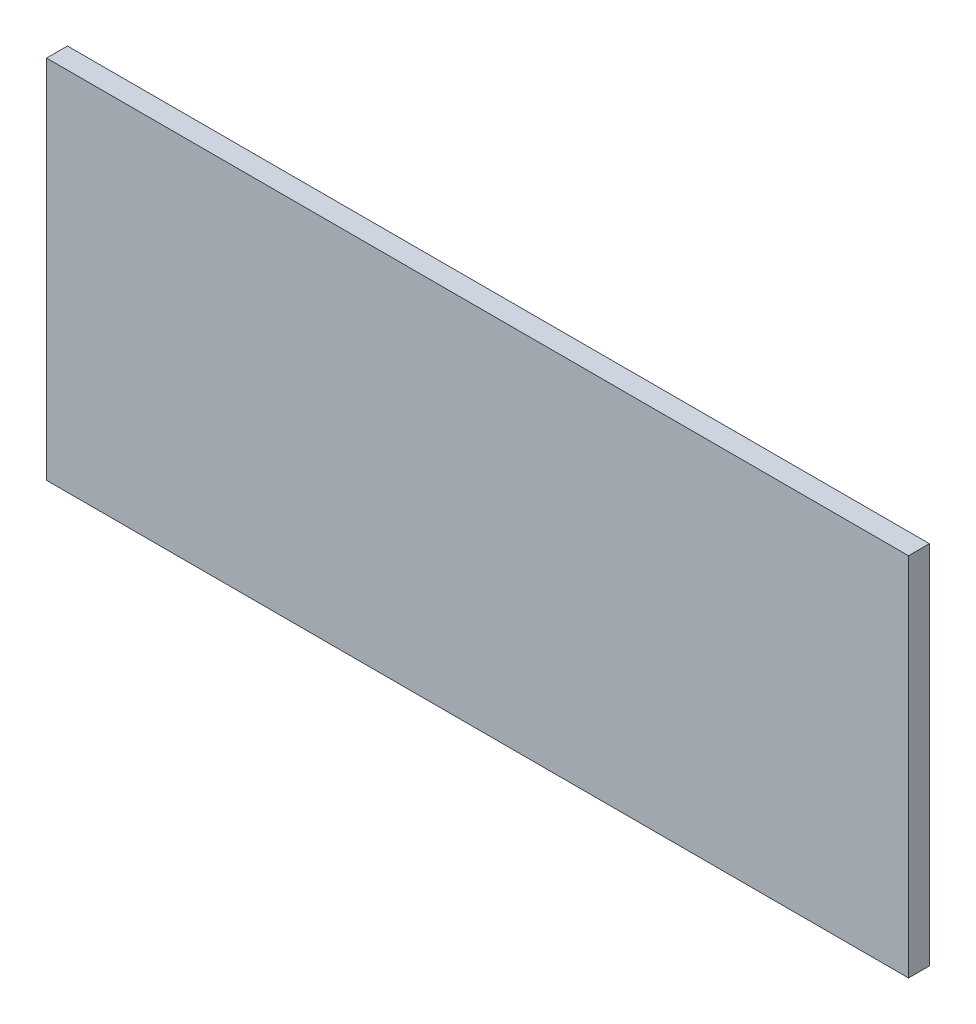
ISO-10303-21;
HEADER;
FILE_DESCRIPTION(('STEP AP214'),'2;1');
FILE_NAME('part.step','',(''),(''),'','','');
FILE_SCHEMA(('AUTOMOTIVE_DESIGN { 1 0 10303 214 1 1 1 1 }'));
ENDSEC;
DATA;
#1=APPLICATION_CONTEXT('core data for automotive mechanical design processes');
#2=APPLICATION_PROTOCOL_DEFINITION('international standard','automotive_design',2000,#1);
#3=PRODUCT_CONTEXT('',#1,'mechanical');
#4=PRODUCT('Part','Part','',(#3));
#5=PRODUCT_RELATED_PRODUCT_CATEGORY('part','',(#4));
#6=PRODUCT_DEFINITION_FORMATION('','',#4);
#7=PRODUCT_DEFINITION_CONTEXT('part definition',#1,'design');
#8=PRODUCT_DEFINITION('design','',#6,#7);
#9=PRODUCT_DEFINITION_SHAPE('','',#8);
#10=(LENGTH_UNIT() NAMED_UNIT(*) SI_UNIT(.MILLI.,.METRE.));
#11=(NAMED_UNIT(*) PLANE_ANGLE_UNIT() SI_UNIT($,.RADIAN.));
#12=(NAMED_UNIT(*) SI_UNIT($,.STERADIAN.) SOLID_ANGLE_UNIT());
#13=UNCERTAINTY_MEASURE_WITH_UNIT(LENGTH_MEASURE(1.E-05),#10,'distance_accuracy_value','');
#14=(GEOMETRIC_REPRESENTATION_CONTEXT(3) GLOBAL_UNCERTAINTY_ASSIGNED_CONTEXT((#13)) GLOBAL_UNIT_ASSIGNED_CONTEXT((#10,
#11,#12)) REPRESENTATION_CONTEXT('',''));
#15=CARTESIAN_POINT('',(0.,0.,0.));
#16=DIRECTION('',(0.,0.,1.));
#17=DIRECTION('',(1.,0.,0.));
#18=AXIS2_PLACEMENT_3D('',#15,#16,#17);
#19=CARTESIAN_POINT('',(-82.5,-35.,4.));
#20=DIRECTION('',(1.,0.,0.));
#21=DIRECTION('',(0.,0.,-1.));
#22=AXIS2_PLACEMENT_3D('',#19,#20,#21);
#23=PLANE('',#22);
#24=DIRECTION('',(0.,-1.,0.));
#25=VECTOR('',#24,1.);
#26=CARTESIAN_POINT('',(-82.5,-35.,0.));
#27=LINE('',#26,#25);
#28=CARTESIAN_POINT('',(-82.5,35.,0.));
#29=VERTEX_POINT('',#28);
#30=CARTESIAN_POINT('',(-82.5,-35.,0.));
#31=VERTEX_POINT('',#30);
#32=EDGE_CURVE('E97',#29,#31,#27,.T.);
#33=ORIENTED_EDGE('',*,*,#32,.T.);
#34=DIRECTION('',(0.,0.,-1.));
#35=VECTOR('',#34,1.);
#36=CARTESIAN_POINT('',(-82.5,-35.,4.));
#37=LINE('',#36,#35);
#38=CARTESIAN_POINT('',(-82.5,-35.,4.));
#39=VERTEX_POINT('',#38);
#40=EDGE_CURVE('E11',#39,#31,#37,.T.);
#41=ORIENTED_EDGE('',*,*,#40,.F.);
#42=DIRECTION('',(0.,-1.,0.));
#43=VECTOR('',#42,1.);
#44=CARTESIAN_POINT('',(-82.5,-35.,4.));
#45=LINE('',#44,#43);
#46=CARTESIAN_POINT('',(-82.5,35.,4.));
#47=VERTEX_POINT('',#46);
#48=EDGE_CURVE('E85',#47,#39,#45,.T.);
#49=ORIENTED_EDGE('',*,*,#48,.F.);
#50=DIRECTION('',(0.,0.,-1.));
#51=VECTOR('',#50,1.);
#52=CARTESIAN_POINT('',(-82.5,35.,4.));
#53=LINE('',#52,#51);
#54=EDGE_CURVE('E93',#47,#29,#53,.T.);
#55=ORIENTED_EDGE('',*,*,#54,.T.);
#56=EDGE_LOOP('',(#33,#41,#49,#55));
#57=FACE_BOUND('',#56,.T.);
#58=ADVANCED_FACE('F34',(#57),#23,.F.);
#59=CARTESIAN_POINT('',(82.5,-35.,4.));
#60=DIRECTION('',(0.,1.,0.));
#61=DIRECTION('',(-1.,0.,0.));
#62=AXIS2_PLACEMENT_3D('',#59,#60,#61);
#63=PLANE('',#62);
#64=DIRECTION('',(1.,0.,0.));
#65=VECTOR('',#64,1.);
#66=CARTESIAN_POINT('',(82.5,-35.,0.));
#67=LINE('',#66,#65);
#68=CARTESIAN_POINT('',(82.5,-35.,0.));
#69=VERTEX_POINT('',#68);
#70=EDGE_CURVE('E89',#31,#69,#67,.T.);
#71=ORIENTED_EDGE('',*,*,#70,.T.);
#72=DIRECTION('',(0.,0.,-1.));
#73=VECTOR('',#72,1.);
#74=CARTESIAN_POINT('',(82.5,-35.,4.));
#75=LINE('',#74,#73);
#76=CARTESIAN_POINT('',(82.5,-35.,4.));
#77=VERTEX_POINT('',#76);
#78=EDGE_CURVE('E42',#77,#69,#75,.T.);
#79=ORIENTED_EDGE('',*,*,#78,.F.);
#80=DIRECTION('',(1.,0.,0.));
#81=VECTOR('',#80,1.);
#82=CARTESIAN_POINT('',(82.5,-35.,4.));
#83=LINE('',#82,#81);
#84=EDGE_CURVE('E80',#39,#77,#83,.T.);
#85=ORIENTED_EDGE('',*,*,#84,.F.);
#86=ORIENTED_EDGE('',*,*,#40,.T.);
#87=EDGE_LOOP('',(#71,#79,#85,#86));
#88=FACE_BOUND('',#87,.T.);
#89=ADVANCED_FACE('F88',(#88),#63,.F.);
#90=CARTESIAN_POINT('',(82.5,-35.,4.));
#91=DIRECTION('',(-1.,0.,0.));
#92=DIRECTION('',(0.,0.,1.));
#93=AXIS2_PLACEMENT_3D('',#90,#91,#92);
#94=PLANE('',#93);
#95=DIRECTION('',(0.,1.,0.));
#96=VECTOR('',#95,1.);
#97=CARTESIAN_POINT('',(82.5,-35.,0.));
#98=LINE('',#97,#96);
#99=CARTESIAN_POINT('',(82.5,35.,0.));
#100=VERTEX_POINT('',#99);
#101=EDGE_CURVE('E67',#69,#100,#98,.T.);
#102=ORIENTED_EDGE('',*,*,#101,.T.);
#103=DIRECTION('',(0.,0.,-1.));
#104=VECTOR('',#103,1.);
#105=CARTESIAN_POINT('',(82.5,35.,4.));
#106=LINE('',#105,#104);
#107=CARTESIAN_POINT('',(82.5,35.,4.));
#108=VERTEX_POINT('',#107);
#109=EDGE_CURVE('E90',#108,#100,#106,.T.);
#110=ORIENTED_EDGE('',*,*,#109,.F.);
#111=DIRECTION('',(0.,1.,0.));
#112=VECTOR('',#111,1.);
#113=CARTESIAN_POINT('',(82.5,-35.,4.));
#114=LINE('',#113,#112);
#115=EDGE_CURVE('E83',#77,#108,#114,.T.);
#116=ORIENTED_EDGE('',*,*,#115,.F.);
#117=ORIENTED_EDGE('',*,*,#78,.T.);
#118=EDGE_LOOP('',(#102,#110,#116,#117));
#119=FACE_BOUND('',#118,.T.);
#120=ADVANCED_FACE('F91',(#119),#94,.F.);
#121=CARTESIAN_POINT('',(82.5,35.,4.));
#122=DIRECTION('',(0.,-1.,0.));
#123=DIRECTION('',(1.,0.,0.));
#124=AXIS2_PLACEMENT_3D('',#121,#122,#123);
#125=PLANE('',#124);
#126=DIRECTION('',(-1.,0.,0.));
#127=VECTOR('',#126,1.);
#128=CARTESIAN_POINT('',(82.5,35.,0.));
#129=LINE('',#128,#127);
#130=EDGE_CURVE('E73',#100,#29,#129,.T.);
#131=ORIENTED_EDGE('',*,*,#130,.T.);
#132=ORIENTED_EDGE('',*,*,#54,.F.);
#133=DIRECTION('',(-1.,0.,0.));
#134=VECTOR('',#133,1.);
#135=CARTESIAN_POINT('',(82.5,35.,4.));
#136=LINE('',#135,#134);
#137=EDGE_CURVE('E50',#108,#47,#136,.T.);
#138=ORIENTED_EDGE('',*,*,#137,.F.);
#139=ORIENTED_EDGE('',*,*,#109,.T.);
#140=EDGE_LOOP('',(#131,#132,#138,#139));
#141=FACE_BOUND('',#140,.T.);
#142=ADVANCED_FACE('F104',(#141),#125,.F.);
#143=CARTESIAN_POINT('',(0.,0.,4.));
#144=DIRECTION('',(0.,0.,1.));
#145=DIRECTION('',(1.,0.,0.));
#146=AXIS2_PLACEMENT_3D('',#143,#144,#145);
#147=PLANE('',#146);
#148=ORIENTED_EDGE('',*,*,#48,.T.);
#149=ORIENTED_EDGE('',*,*,#84,.T.);
#150=ORIENTED_EDGE('',*,*,#115,.T.);
#151=ORIENTED_EDGE('',*,*,#137,.T.);
#152=EDGE_LOOP('',(#148,#149,#150,#151));
#153=FACE_BOUND('',#152,.T.);
#154=ADVANCED_FACE('F81',(#153),#147,.T.);
#155=CARTESIAN_POINT('',(0.,0.,0.));
#156=DIRECTION('',(0.,0.,1.));
#157=DIRECTION('',(1.,0.,0.));
#158=AXIS2_PLACEMENT_3D('',#155,#156,#157);
#159=PLANE('',#158);
#160=ORIENTED_EDGE('',*,*,#32,.F.);
#161=ORIENTED_EDGE('',*,*,#130,.F.);
#162=ORIENTED_EDGE('',*,*,#101,.F.);
#163=ORIENTED_EDGE('',*,*,#70,.F.);
#164=EDGE_LOOP('',(#160,#161,#162,#163));
#165=FACE_BOUND('',#164,.T.);
#166=ADVANCED_FACE('F107',(#165),#159,.F.);
#167=CLOSED_SHELL('',(#58,#89,#120,#142,#154,#166));
#168=MANIFOLD_SOLID_BREP('B2',#167);
#169=ADVANCED_BREP_SHAPE_REPRESENTATION('',(#18,#168),#14);
#170=SHAPE_DEFINITION_REPRESENTATION(#9,#169);
ENDSEC;
END-ISO-10303-21;
